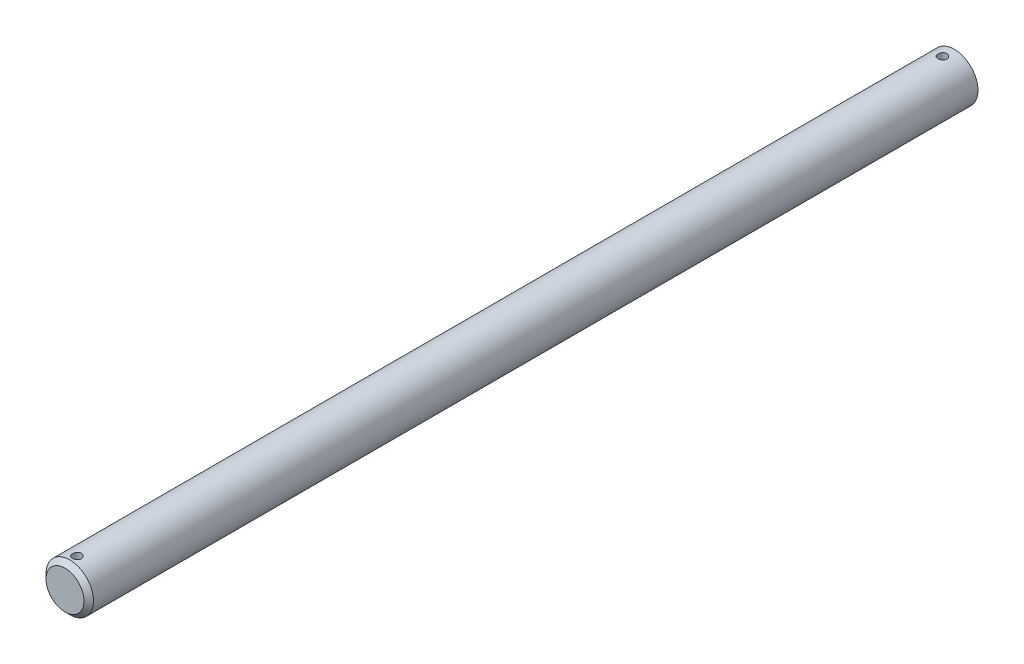
ISO-10303-21;
HEADER;
FILE_DESCRIPTION(('STEP AP214'),'2;1');
FILE_NAME('part.step','',(''),(''),'','','');
FILE_SCHEMA(('AUTOMOTIVE_DESIGN { 1 0 10303 214 1 1 1 1 }'));
ENDSEC;
DATA;
#1=APPLICATION_CONTEXT('core data for automotive mechanical design processes');
#2=APPLICATION_PROTOCOL_DEFINITION('international standard','automotive_design',2000,#1);
#3=PRODUCT_CONTEXT('',#1,'mechanical');
#4=PRODUCT('Part','Part','',(#3));
#5=PRODUCT_RELATED_PRODUCT_CATEGORY('part','',(#4));
#6=PRODUCT_DEFINITION_FORMATION('','',#4);
#7=PRODUCT_DEFINITION_CONTEXT('part definition',#1,'design');
#8=PRODUCT_DEFINITION('design','',#6,#7);
#9=PRODUCT_DEFINITION_SHAPE('','',#8);
#10=(LENGTH_UNIT() NAMED_UNIT(*) SI_UNIT(.MILLI.,.METRE.));
#11=(NAMED_UNIT(*) PLANE_ANGLE_UNIT() SI_UNIT($,.RADIAN.));
#12=(NAMED_UNIT(*) SI_UNIT($,.STERADIAN.) SOLID_ANGLE_UNIT());
#13=UNCERTAINTY_MEASURE_WITH_UNIT(LENGTH_MEASURE(1.E-05),#10,'distance_accuracy_value','');
#14=(GEOMETRIC_REPRESENTATION_CONTEXT(3) GLOBAL_UNCERTAINTY_ASSIGNED_CONTEXT((#13)) GLOBAL_UNIT_ASSIGNED_CONTEXT((#10,
#11,#12)) REPRESENTATION_CONTEXT('',''));
#15=CARTESIAN_POINT('',(0.,0.,0.));
#16=DIRECTION('',(0.,0.,1.));
#17=DIRECTION('',(1.,0.,0.));
#18=AXIS2_PLACEMENT_3D('',#15,#16,#17);
#19=CARTESIAN_POINT('',(0.,0.,304.8));
#20=DIRECTION('',(0.,0.,-1.));
#21=DIRECTION('',(-1.,0.,0.));
#22=AXIS2_PLACEMENT_3D('',#19,#20,#21);
#23=CYLINDRICAL_SURFACE('',#22,3.175);
#24=CARTESIAN_POINT('',(0.,-3.17500000000001,188.0631875));
#25=CARTESIAN_POINT('',(0.0331278493784855,-3.17499940005936,188.063186234132));
#26=CARTESIAN_POINT('',(0.0662721689897608,-3.17447616437681,188.060412916467));
#27=CARTESIAN_POINT('',(0.131626820280967,-3.17243930650301,188.049400064437));
#28=CARTESIAN_POINT('',(0.163836339741668,-3.17092484847488,188.041155916777));
#29=CARTESIAN_POINT('',(0.226366769234937,-3.16707495697542,188.019462709188));
#30=CARTESIAN_POINT('',(0.256689356240749,-3.16474026510011,188.006018349808));
#31=CARTESIAN_POINT('',(0.314645664321688,-3.1595048514429,187.974319695721));
#32=CARTESIAN_POINT('',(0.342279602808192,-3.1566041754851,187.956065790371));
#33=CARTESIAN_POINT('',(0.394407912259927,-3.15051811645857,187.915034154574));
#34=CARTESIAN_POINT('',(0.41886542902827,-3.14733001333615,187.892210001647));
#35=CARTESIAN_POINT('',(0.463627811849758,-3.14104860763278,187.842785624206));
#36=CARTESIAN_POINT('',(0.483932379579187,-3.13795531187579,187.816185128654));
#37=CARTESIAN_POINT('',(0.519965775954879,-3.13218731275362,187.759702708681));
#38=CARTESIAN_POINT('',(0.535657115316887,-3.12951611636079,187.72979647803));
#39=CARTESIAN_POINT('',(0.561778643443761,-3.12493308056008,187.667713899289));
#40=CARTESIAN_POINT('',(0.572209285923867,-3.1230211756692,187.635537747243));
#41=CARTESIAN_POINT('',(0.587395056092025,-3.120200569874,187.570223017731));
#42=CARTESIAN_POINT('',(0.592214454824665,-3.11928051754792,187.537099883297));
#43=CARTESIAN_POINT('',(0.596240425878419,-3.11851356370003,187.470503350404));
#44=CARTESIAN_POINT('',(0.595447501537278,-3.11866656594196,187.437029983624));
#45=CARTESIAN_POINT('',(0.588323450296886,-3.12001809916009,187.37114881341));
#46=CARTESIAN_POINT('',(0.582065407796812,-3.12120283233474,187.338732782137));
#47=CARTESIAN_POINT('',(0.564303860103706,-3.12446266491103,187.275419033399));
#48=CARTESIAN_POINT('',(0.552800132013025,-3.12653780214715,187.244521380514));
#49=CARTESIAN_POINT('',(0.524802287242862,-3.13135905069247,187.184907618022));
#50=CARTESIAN_POINT('',(0.508278659956949,-3.13410911079899,187.156205700738));
#51=CARTESIAN_POINT('',(0.470730932942598,-3.13996773104909,187.101954373361));
#52=CARTESIAN_POINT('',(0.449706376466779,-3.14307632756161,187.076405283626));
#53=CARTESIAN_POINT('',(0.403359563188532,-3.14936188004891,187.028762595718));
#54=CARTESIAN_POINT('',(0.377974795254098,-3.15253914125163,187.006729803558));
#55=CARTESIAN_POINT('',(0.323837314723618,-3.15855900111739,186.967226220107));
#56=CARTESIAN_POINT('',(0.295084568364029,-3.16140159642489,186.949755474555));
#57=CARTESIAN_POINT('',(0.234963886209652,-3.16643757934512,186.919862953933));
#58=CARTESIAN_POINT('',(0.203592733389718,-3.16863015282215,186.907447503288));
#59=CARTESIAN_POINT('',(0.139159898923868,-3.17211275581705,186.888079481804));
#60=CARTESIAN_POINT('',(0.106098397260253,-3.17340288121049,186.881126330645));
#61=CARTESIAN_POINT('',(0.0397464966210338,-3.17492205629787,186.87296491894));
#62=CARTESIAN_POINT('',(0.00646668626417494,-3.17516649268312,186.871673344612));
#63=CARTESIAN_POINT('',(-0.0598333703365843,-3.17460925115548,186.874648268445));
#64=CARTESIAN_POINT('',(-0.0928536292531527,-3.1738076246401,186.878914493529));
#65=CARTESIAN_POINT('',(-0.157432999370982,-3.17125791126725,186.892814648338));
#66=CARTESIAN_POINT('',(-0.189001503602659,-3.16951726067194,186.902406421507));
#67=CARTESIAN_POINT('',(-0.250082300755403,-3.16528387378086,186.926639777378));
#68=CARTESIAN_POINT('',(-0.279594453904931,-3.16279108642312,186.94128170294));
#69=CARTESIAN_POINT('',(-0.336080366506808,-3.157291557982,186.975384132113));
#70=CARTESIAN_POINT('',(-0.363022863065382,-3.1542794982553,186.994895543107));
#71=CARTESIAN_POINT('',(-0.413281147045624,-3.1480892694748,187.038114198266));
#72=CARTESIAN_POINT('',(-0.436596595436349,-3.14491108492986,187.061821834222));
#73=CARTESIAN_POINT('',(-0.479255517992202,-3.13869576292426,187.113137139068));
#74=CARTESIAN_POINT('',(-0.498542136242495,-3.1356610588829,187.140792416662));
#75=CARTESIAN_POINT('',(-0.532196179135612,-3.1301252865148,187.198999182233));
#76=CARTESIAN_POINT('',(-0.546563786592778,-3.12762419835761,187.229550562522));
#77=CARTESIAN_POINT('',(-0.569891360504028,-3.12345793983175,187.292537953562));
#78=CARTESIAN_POINT('',(-0.578877385529317,-3.12178874798387,187.324964035013));
#79=CARTESIAN_POINT('',(-0.591267071076006,-3.11946609009084,187.390899991438));
#80=CARTESIAN_POINT('',(-0.594671361418134,-3.11881250944861,187.424409743701));
#81=CARTESIAN_POINT('',(-0.595779868526294,-3.11860088672157,187.490992306541));
#82=CARTESIAN_POINT('',(-0.593573770795146,-3.11902560714798,187.524063602442));
#83=CARTESIAN_POINT('',(-0.583720477284632,-3.12088450886938,187.589355033124));
#84=CARTESIAN_POINT('',(-0.576073314010796,-3.12231868413375,187.621575172988));
#85=CARTESIAN_POINT('',(-0.555592803846086,-3.126027641217,187.684201436153));
#86=CARTESIAN_POINT('',(-0.542769168607853,-3.12830084823628,187.71461083469));
#87=CARTESIAN_POINT('',(-0.512309542245322,-3.13343285059637,187.772860838402));
#88=CARTESIAN_POINT('',(-0.49467321113813,-3.13629168730423,187.80070126191));
#89=CARTESIAN_POINT('',(-0.4547770278788,-3.14232633736512,187.853472273017));
#90=CARTESIAN_POINT('',(-0.432451906336468,-3.1455062556199,187.878353054363));
#91=CARTESIAN_POINT('',(-0.383947958425856,-3.15179405961499,187.924045173853));
#92=CARTESIAN_POINT('',(-0.357768247938247,-3.15490192863972,187.944855575827));
#93=CARTESIAN_POINT('',(-0.302015900075409,-3.1607282796232,187.981991221824));
#94=CARTESIAN_POINT('',(-0.27241483753546,-3.1634430039313,187.998274398182));
#95=CARTESIAN_POINT('',(-0.210855763856365,-3.16814048941711,188.025610437028));
#96=CARTESIAN_POINT('',(-0.178899999270518,-3.17012393770744,188.036668212109));
#97=CARTESIAN_POINT('',(-0.122375296121229,-3.17273102874592,188.05099443416));
#98=CARTESIAN_POINT('',(-0.0981367934437087,-3.17357708754789,188.055559018905));
#99=CARTESIAN_POINT('',(-0.0492685574488272,-3.17471178919249,188.061655984027));
#100=CARTESIAN_POINT('',(-0.0246388340934183,-3.1750004462058,188.063188441489));
#101=CARTESIAN_POINT('',(0.,-3.17500000000001,188.0631875));
#102=B_SPLINE_CURVE_WITH_KNOTS('',3,(#24,#25,#26,#27,#28,#29,#30,#31,#32,#33,#34,#35,#36,#37,
#38,#39,#40,#41,#42,#43,#44,#45,#46,#47,#48,#49,#50,#51,#52,#53,#54,#55,#56,#57,#58,#59,#60,#61,
#62,#63,#64,#65,#66,#67,#68,#69,#70,#71,#72,#73,#74,#75,#76,#77,#78,#79,#80,#81,#82,#83,#84,#85,
#86,#87,#88,#89,#90,#91,#92,#93,#94,#95,#96,#97,#98,#99,#100,#101),.UNSPECIFIED.,.T.,.F.,(4,2,2,
2,2,2,2,2,2,2,2,2,2,2,2,2,2,2,2,2,2,2,2,2,2,2,2,2,2,2,2,2,2,2,2,2,2,2,4),(0.,0.0992934422579592,
0.198670720631257,0.297958379519774,0.397238003055785,0.49758249961661,0.597934201813109,
0.699080193564203,0.800217460363052,0.900184538548683,1.00014265136194,1.09878415868193,
1.19742985782943,1.29666707356097,1.3959143645104,1.4967258310918,1.59753830838152,
1.69847652240176,1.79940401117395,1.89884119086454,1.99827348496884,2.09692967832173,
2.19559257087285,2.29533361900781,2.39508398463951,2.49615895304341,2.59723016460249,
2.69780792915495,2.79837434413152,2.89734328229483,2.99631162921165,3.09509515682432,
3.19388566460125,3.29415524955412,3.39444786907213,3.49564344413668,3.59674369125816,
3.67059505483131,3.74444454087574),.UNSPECIFIED.);
#103=CARTESIAN_POINT('',(0.,-3.17500000000001,188.0631875));
#104=VERTEX_POINT('',#103);
#105=EDGE_CURVE('E10',#104,#104,#102,.T.);
#106=ORIENTED_EDGE('',*,*,#105,.T.);
#107=EDGE_LOOP('',(#106));
#108=FACE_BOUND('',#107,.T.);
#109=CARTESIAN_POINT('',(0.,3.17499999999999,188.0631875));
#110=CARTESIAN_POINT('',(-0.0331278493784852,3.17499940005934,188.063186234132));
#111=CARTESIAN_POINT('',(-0.0662721689897606,3.1744761643768,188.060412916467));
#112=CARTESIAN_POINT('',(-0.131626820280967,3.17243930650299,188.049400064437));
#113=CARTESIAN_POINT('',(-0.163836339741668,3.17092484847486,188.041155916777));
#114=CARTESIAN_POINT('',(-0.226366769234937,3.1670749569754,188.019462709188));
#115=CARTESIAN_POINT('',(-0.256689356240749,3.16474026510009,188.006018349808));
#116=CARTESIAN_POINT('',(-0.314645664321687,3.15950485144288,187.974319695721));
#117=CARTESIAN_POINT('',(-0.342279602808192,3.15660417548508,187.956065790371));
#118=CARTESIAN_POINT('',(-0.394407912259927,3.15051811645855,187.915034154574));
#119=CARTESIAN_POINT('',(-0.418865429028269,3.14733001333613,187.892210001647));
#120=CARTESIAN_POINT('',(-0.463627811849758,3.14104860763276,187.842785624206));
#121=CARTESIAN_POINT('',(-0.483932379579187,3.13795531187577,187.816185128654));
#122=CARTESIAN_POINT('',(-0.519965775954873,3.1321873127536,187.759702708681));
#123=CARTESIAN_POINT('',(-0.535657115316879,3.12951611636077,187.72979647803));
#124=CARTESIAN_POINT('',(-0.561778643443756,3.12493308056006,187.667713899289));
#125=CARTESIAN_POINT('',(-0.572209285923865,3.12302117566918,187.635537747243));
#126=CARTESIAN_POINT('',(-0.587395056092024,3.12020056987398,187.570223017731));
#127=CARTESIAN_POINT('',(-0.592214454824665,3.11928051754791,187.537099883297));
#128=CARTESIAN_POINT('',(-0.596240425878419,3.11851356370001,187.470503350404));
#129=CARTESIAN_POINT('',(-0.595447501537278,3.11866656594194,187.437029983624));
#130=CARTESIAN_POINT('',(-0.588323450296886,3.12001809916007,187.37114881341));
#131=CARTESIAN_POINT('',(-0.582065407796812,3.12120283233472,187.338732782137));
#132=CARTESIAN_POINT('',(-0.564303860103706,3.12446266491101,187.275419033399));
#133=CARTESIAN_POINT('',(-0.552800132013025,3.12653780214713,187.244521380514));
#134=CARTESIAN_POINT('',(-0.524802287242861,3.13135905069245,187.184907618022));
#135=CARTESIAN_POINT('',(-0.508278659956948,3.13410911079897,187.156205700738));
#136=CARTESIAN_POINT('',(-0.470730932942597,3.13996773104907,187.101954373361));
#137=CARTESIAN_POINT('',(-0.449706376466778,3.14307632756159,187.076405283626));
#138=CARTESIAN_POINT('',(-0.403359563188532,3.14936188004889,187.028762595718));
#139=CARTESIAN_POINT('',(-0.377974795254097,3.15253914125161,187.006729803558));
#140=CARTESIAN_POINT('',(-0.323837314723618,3.15855900111738,186.967226220107));
#141=CARTESIAN_POINT('',(-0.295084568364029,3.16140159642487,186.949755474555));
#142=CARTESIAN_POINT('',(-0.234963886209651,3.1664375793451,186.919862953933));
#143=CARTESIAN_POINT('',(-0.203592733389718,3.16863015282214,186.907447503288));
#144=CARTESIAN_POINT('',(-0.139159898923867,3.17211275581703,186.888079481804));
#145=CARTESIAN_POINT('',(-0.106098397260253,3.17340288121047,186.881126330645));
#146=CARTESIAN_POINT('',(-0.0397464966210337,3.17492205629785,186.87296491894));
#147=CARTESIAN_POINT('',(-0.00646668626417481,3.1751664926831,186.871673344612));
#148=CARTESIAN_POINT('',(0.0598333703365844,3.17460925115546,186.874648268445));
#149=CARTESIAN_POINT('',(0.0928536292531528,3.17380762464008,186.878914493529));
#150=CARTESIAN_POINT('',(0.157432999370982,3.17125791126723,186.892814648338));
#151=CARTESIAN_POINT('',(0.189001503602659,3.16951726067192,186.902406421507));
#152=CARTESIAN_POINT('',(0.250082300755403,3.16528387378084,186.926639777378));
#153=CARTESIAN_POINT('',(0.279594453904931,3.1627910864231,186.94128170294));
#154=CARTESIAN_POINT('',(0.336080366506808,3.15729155798198,186.975384132113));
#155=CARTESIAN_POINT('',(0.363022863065382,3.15427949825529,186.994895543107));
#156=CARTESIAN_POINT('',(0.413281147045624,3.14808926947478,187.038114198266));
#157=CARTESIAN_POINT('',(0.436596595436349,3.14491108492984,187.061821834222));
#158=CARTESIAN_POINT('',(0.479255517992202,3.13869576292424,187.113137139068));
#159=CARTESIAN_POINT('',(0.498542136242496,3.13566105888288,187.140792416662));
#160=CARTESIAN_POINT('',(0.532196179135613,3.13012528651479,187.198999182233));
#161=CARTESIAN_POINT('',(0.546563786592779,3.12762419835759,187.229550562522));
#162=CARTESIAN_POINT('',(0.569891360504028,3.12345793983173,187.292537953562));
#163=CARTESIAN_POINT('',(0.578877385529318,3.12178874798385,187.324964035013));
#164=CARTESIAN_POINT('',(0.591267071076006,3.11946609009082,187.390899991438));
#165=CARTESIAN_POINT('',(0.594671361418134,3.11881250944859,187.424409743701));
#166=CARTESIAN_POINT('',(0.595779868526294,3.11860088672155,187.490992306541));
#167=CARTESIAN_POINT('',(0.593573770795146,3.11902560714797,187.524063602442));
#168=CARTESIAN_POINT('',(0.583720477284632,3.12088450886936,187.589355033124));
#169=CARTESIAN_POINT('',(0.576073314010796,3.12231868413373,187.621575172988));
#170=CARTESIAN_POINT('',(0.555592803846086,3.12602764121698,187.684201436153));
#171=CARTESIAN_POINT('',(0.542769168607853,3.12830084823626,187.71461083469));
#172=CARTESIAN_POINT('',(0.512309542245322,3.13343285059635,187.772860838402));
#173=CARTESIAN_POINT('',(0.49467321113813,3.13629168730421,187.80070126191));
#174=CARTESIAN_POINT('',(0.4547770278788,3.1423263373651,187.853472273017));
#175=CARTESIAN_POINT('',(0.432451906336468,3.14550625561988,187.878353054363));
#176=CARTESIAN_POINT('',(0.383947958425856,3.15179405961497,187.924045173853));
#177=CARTESIAN_POINT('',(0.357768247938247,3.1549019286397,187.944855575827));
#178=CARTESIAN_POINT('',(0.302015900075409,3.16072827962318,187.981991221824));
#179=CARTESIAN_POINT('',(0.272414837535461,3.16344300393128,187.998274398182));
#180=CARTESIAN_POINT('',(0.210855763856365,3.16814048941709,188.025610437028));
#181=CARTESIAN_POINT('',(0.178899999270518,3.17012393770742,188.036668212109));
#182=CARTESIAN_POINT('',(0.12237529612123,3.17273102874591,188.05099443416));
#183=CARTESIAN_POINT('',(0.0981367934437089,3.17357708754787,188.055559018905));
#184=CARTESIAN_POINT('',(0.0492685574488273,3.17471178919247,188.061655984027));
#185=CARTESIAN_POINT('',(0.0246388340934185,3.17500044620578,188.063188441489));
#186=CARTESIAN_POINT('',(0.,3.17499999999999,188.0631875));
#187=B_SPLINE_CURVE_WITH_KNOTS('',3,(#109,#110,#111,#112,#113,#114,#115,#116,#117,#118,#119,
#120,#121,#122,#123,#124,#125,#126,#127,#128,#129,#130,#131,#132,#133,#134,#135,#136,#137,#138,
#139,#140,#141,#142,#143,#144,#145,#146,#147,#148,#149,#150,#151,#152,#153,#154,#155,#156,#157,
#158,#159,#160,#161,#162,#163,#164,#165,#166,#167,#168,#169,#170,#171,#172,#173,#174,#175,#176,
#177,#178,#179,#180,#181,#182,#183,#184,#185,#186),.UNSPECIFIED.,.T.,.F.,(4,2,2,2,2,2,2,2,2,2,2,
2,2,2,2,2,2,2,2,2,2,2,2,2,2,2,2,2,2,2,2,2,2,2,2,2,2,2,4),(0.,0.0992934422579592,
0.198670720631257,0.297958379519774,0.397238003055785,0.49758249961661,0.597934201813109,
0.699080193564174,0.800217460363052,0.900184538548683,1.00014265136194,1.09878415868193,
1.19742985782943,1.29666707356097,1.3959143645104,1.4967258310918,1.59753830838152,
1.69847652240176,1.79940401117395,1.89884119086454,1.99827348496884,2.09692967832173,
2.19559257087285,2.29533361900781,2.39508398463951,2.49615895304341,2.59723016460249,
2.69780792915495,2.79837434413152,2.89734328229483,2.99631162921165,3.09509515682432,
3.19388566460125,3.29415524955412,3.39444786907213,3.49564344413668,3.59674369125816,
3.67059505483131,3.74444454087574),.UNSPECIFIED.);
#188=CARTESIAN_POINT('',(0.,3.17499999999999,188.0631875));
#189=VERTEX_POINT('',#188);
#190=EDGE_CURVE('E50',#189,#189,#187,.T.);
#191=ORIENTED_EDGE('',*,*,#190,.T.);
#192=EDGE_LOOP('',(#191));
#193=FACE_BOUND('',#192,.T.);
#194=CARTESIAN_POINT('',(0.,-3.17500000000001,303.8078125));
#195=CARTESIAN_POINT('',(0.0331278493784956,-3.17499940005936,303.807811234132));
#196=CARTESIAN_POINT('',(0.0662721689897699,-3.17447616437681,303.805037916467));
#197=CARTESIAN_POINT('',(0.131626820280976,-3.17243930650301,303.794025064437));
#198=CARTESIAN_POINT('',(0.163836339741677,-3.17092484847488,303.785780916777));
#199=CARTESIAN_POINT('',(0.226366769234958,-3.16707495697542,303.764087709188));
#200=CARTESIAN_POINT('',(0.256689356240781,-3.16474026510011,303.750643349808));
#201=CARTESIAN_POINT('',(0.314645664321714,-3.15950485144289,303.718944695721));
#202=CARTESIAN_POINT('',(0.342279602808203,-3.15660417548509,303.700690790371));
#203=CARTESIAN_POINT('',(0.394407912259931,-3.15051811645857,303.659659154574));
#204=CARTESIAN_POINT('',(0.41886542902828,-3.14733001333615,303.636835001646));
#205=CARTESIAN_POINT('',(0.463627811849776,-3.14104860763277,303.587410624206));
#206=CARTESIAN_POINT('',(0.483932379579207,-3.13795531187578,303.560810128654));
#207=CARTESIAN_POINT('',(0.519965775954901,-3.13218731275362,303.504327708681));
#208=CARTESIAN_POINT('',(0.535657115316909,-3.12951611636079,303.47442147803));
#209=CARTESIAN_POINT('',(0.561778643443776,-3.12493308056008,303.412338899289));
#210=CARTESIAN_POINT('',(0.572209285923881,-3.1230211756692,303.380162747243));
#211=CARTESIAN_POINT('',(0.587395056092034,-3.120200569874,303.314848017731));
#212=CARTESIAN_POINT('',(0.592214454824669,-3.11928051754792,303.281724883297));
#213=CARTESIAN_POINT('',(0.596240425878417,-3.11851356370003,303.215128350404));
#214=CARTESIAN_POINT('',(0.595447501537278,-3.11866656594196,303.181654983624));
#215=CARTESIAN_POINT('',(0.58832345029689,-3.12001809916009,303.11577381341));
#216=CARTESIAN_POINT('',(0.582065407796815,-3.12120283233474,303.083357782137));
#217=CARTESIAN_POINT('',(0.564303860103707,-3.12446266491103,303.020044033399));
#218=CARTESIAN_POINT('',(0.552800132013023,-3.12653780214715,302.989146380513));
#219=CARTESIAN_POINT('',(0.524802287242861,-3.13135905069247,302.929532618022));
#220=CARTESIAN_POINT('',(0.508278659956958,-3.13410911079899,302.900830700738));
#221=CARTESIAN_POINT('',(0.470730932942623,-3.13996773104909,302.846579373361));
#222=CARTESIAN_POINT('',(0.449706376466809,-3.14307632756161,302.821030283626));
#223=CARTESIAN_POINT('',(0.403359563188558,-3.14936188004891,302.773387595718));
#224=CARTESIAN_POINT('',(0.377974795254109,-3.15253914125163,302.751354803558));
#225=CARTESIAN_POINT('',(0.323837314723599,-3.1585590011174,302.711851220107));
#226=CARTESIAN_POINT('',(0.295084568363997,-3.16140159642489,302.694380474555));
#227=CARTESIAN_POINT('',(0.234963886209613,-3.16643757934512,302.664487953933));
#228=CARTESIAN_POINT('',(0.203592733389688,-3.16863015282216,302.652072503288));
#229=CARTESIAN_POINT('',(0.139159898923856,-3.17211275581705,302.632704481804));
#230=CARTESIAN_POINT('',(0.106098397260251,-3.17340288121049,302.625751330645));
#231=CARTESIAN_POINT('',(0.0397464966210445,-3.17492205629787,302.61758991894));
#232=CARTESIAN_POINT('',(0.00646668626418795,-3.17516649268312,302.616298344612));
#233=CARTESIAN_POINT('',(-0.0598333703365708,-3.17460925115548,302.619273268446));
#234=CARTESIAN_POINT('',(-0.0928536292531409,-3.1738076246401,302.623539493529));
#235=CARTESIAN_POINT('',(-0.157432999370963,-3.17125791126725,302.637439648338));
#236=CARTESIAN_POINT('',(-0.189001503602631,-3.16951726067195,302.647031421507));
#237=CARTESIAN_POINT('',(-0.250082300755378,-3.16528387378086,302.671264777378));
#238=CARTESIAN_POINT('',(-0.279594453904919,-3.16279108642312,302.68590670294));
#239=CARTESIAN_POINT('',(-0.33608036650679,-3.157291557982,302.720009132113));
#240=CARTESIAN_POINT('',(-0.363022863065345,-3.15427949825531,302.739520543107));
#241=CARTESIAN_POINT('',(-0.413281147045584,-3.14808926947481,302.782739198266));
#242=CARTESIAN_POINT('',(-0.436596595436325,-3.14491108492986,302.806446834222));
#243=CARTESIAN_POINT('',(-0.479255517992183,-3.13869576292427,302.857762139068));
#244=CARTESIAN_POINT('',(-0.498542136242465,-3.13566105888291,302.885417416662));
#245=CARTESIAN_POINT('',(-0.532196179135576,-3.13012528651481,302.943624182233));
#246=CARTESIAN_POINT('',(-0.546563786592745,-3.12762419835762,302.974175562522));
#247=CARTESIAN_POINT('',(-0.569891360503998,-3.12345793983176,303.037162953562));
#248=CARTESIAN_POINT('',(-0.578877385529289,-3.12178874798387,303.069589035013));
#249=CARTESIAN_POINT('',(-0.591267071075983,-3.11946609009085,303.135524991438));
#250=CARTESIAN_POINT('',(-0.594671361418111,-3.11881250944861,303.169034743701));
#251=CARTESIAN_POINT('',(-0.595779868526272,-3.11860088672157,303.235617306541));
#252=CARTESIAN_POINT('',(-0.593573770795127,-3.11902560714799,303.268688602442));
#253=CARTESIAN_POINT('',(-0.583720477284618,-3.12088450886938,303.333980033124));
#254=CARTESIAN_POINT('',(-0.57607331401078,-3.12231868413375,303.366200172988));
#255=CARTESIAN_POINT('',(-0.555592803846065,-3.12602764121701,303.428826436153));
#256=CARTESIAN_POINT('',(-0.542769168607834,-3.12830084823628,303.45923583469));
#257=CARTESIAN_POINT('',(-0.512309542245301,-3.13343285059638,303.517485838402));
#258=CARTESIAN_POINT('',(-0.4946732111381,-3.13629168730423,303.54532626191));
#259=CARTESIAN_POINT('',(-0.454777027878766,-3.14232633736512,303.598097273017));
#260=CARTESIAN_POINT('',(-0.432451906336444,-3.1455062556199,303.622978054363));
#261=CARTESIAN_POINT('',(-0.383947958425829,-3.15179405961499,303.668670173853));
#262=CARTESIAN_POINT('',(-0.357768247938207,-3.15490192863972,303.689480575826));
#263=CARTESIAN_POINT('',(-0.302015900075373,-3.16072827962321,303.726616221824));
#264=CARTESIAN_POINT('',(-0.272414837535442,-3.1634430039313,303.742899398182));
#265=CARTESIAN_POINT('',(-0.21085576385636,-3.16814048941711,303.770235437028));
#266=CARTESIAN_POINT('',(-0.178899999270509,-3.17012393770744,303.781293212109));
#267=CARTESIAN_POINT('',(-0.122375296121215,-3.17273102874592,303.79561943416));
#268=CARTESIAN_POINT('',(-0.0981367934436929,-3.17357708754789,303.800184018905));
#269=CARTESIAN_POINT('',(-0.0492685574488116,-3.17471178919249,303.806280984027));
#270=CARTESIAN_POINT('',(-0.0246388340934046,-3.1750004462058,303.807813441489));
#271=CARTESIAN_POINT('',(0.,-3.17500000000001,303.8078125));
#272=B_SPLINE_CURVE_WITH_KNOTS('',3,(#194,#195,#196,#197,#198,#199,#200,#201,#202,#203,#204,
#205,#206,#207,#208,#209,#210,#211,#212,#213,#214,#215,#216,#217,#218,#219,#220,#221,#222,#223,
#224,#225,#226,#227,#228,#229,#230,#231,#232,#233,#234,#235,#236,#237,#238,#239,#240,#241,#242,
#243,#244,#245,#246,#247,#248,#249,#250,#251,#252,#253,#254,#255,#256,#257,#258,#259,#260,#261,
#262,#263,#264,#265,#266,#267,#268,#269,#270,#271),.UNSPECIFIED.,.T.,.F.,(4,2,2,2,2,2,2,2,2,2,2,
2,2,2,2,2,2,2,2,2,2,2,2,2,2,2,2,2,2,2,2,2,2,2,2,2,2,2,4),(0.,0.0992934422579537,
0.198670720631256,0.297958379519797,0.397238003055775,0.497582499616633,0.597934201813132,
0.699080193564254,0.800217460363045,0.900184538548675,1.00014265136191,1.09878415868192,
1.19742985782948,1.29666707356095,1.39591436451032,1.49672583109181,1.59753830838155,
1.69847652240177,1.79940401117393,1.89884119086451,1.99827348496881,2.09692967832168,
2.1955925708728,2.29533361900778,2.39508398463947,2.49615895304333,2.59723016460242,
2.69780792915486,2.79837434413146,2.89734328229474,2.99631162921161,3.09509515682426,
3.19388566460124,3.29415524955408,3.39444786907209,3.49564344413663,3.5967436912581,
3.67059505483126,3.74444454087568),.UNSPECIFIED.);
#273=CARTESIAN_POINT('',(0.,-3.17500000000001,303.8078125));
#274=VERTEX_POINT('',#273);
#275=EDGE_CURVE('E57',#274,#274,#272,.T.);
#276=ORIENTED_EDGE('',*,*,#275,.T.);
#277=EDGE_LOOP('',(#276));
#278=FACE_BOUND('',#277,.T.);
#279=CARTESIAN_POINT('',(0.,3.17499999999999,303.8078125));
#280=CARTESIAN_POINT('',(-0.0331278493784698,3.17499940005934,303.807811234132));
#281=CARTESIAN_POINT('',(-0.0662721689897442,3.17447616437679,303.805037916467));
#282=CARTESIAN_POINT('',(-0.13162682028095,3.17243930650299,303.794025064437));
#283=CARTESIAN_POINT('',(-0.163836339741651,3.17092484847486,303.785780916777));
#284=CARTESIAN_POINT('',(-0.226366769234933,3.1670749569754,303.764087709188));
#285=CARTESIAN_POINT('',(-0.256689356240756,3.16474026510009,303.750643349808));
#286=CARTESIAN_POINT('',(-0.314645664321688,3.15950485144288,303.718944695721));
#287=CARTESIAN_POINT('',(-0.342279602808177,3.15660417548508,303.700690790371));
#288=CARTESIAN_POINT('',(-0.394407912259905,3.15051811645856,303.659659154574));
#289=CARTESIAN_POINT('',(-0.418865429028254,3.14733001333614,303.636835001646));
#290=CARTESIAN_POINT('',(-0.46362781184975,3.14104860763276,303.587410624206));
#291=CARTESIAN_POINT('',(-0.483932379579181,3.13795531187577,303.560810128654));
#292=CARTESIAN_POINT('',(-0.519965775954875,3.1321873127536,303.504327708681));
#293=CARTESIAN_POINT('',(-0.535657115316883,3.12951611636077,303.47442147803));
#294=CARTESIAN_POINT('',(-0.56177864344375,3.12493308056007,303.412338899289));
#295=CARTESIAN_POINT('',(-0.572209285923855,3.12302117566919,303.380162747243));
#296=CARTESIAN_POINT('',(-0.587395056092009,3.12020056987399,303.314848017731));
#297=CARTESIAN_POINT('',(-0.592214454824643,3.11928051754791,303.281724883297));
#298=CARTESIAN_POINT('',(-0.596240425878392,3.11851356370001,303.215128350404));
#299=CARTESIAN_POINT('',(-0.595447501537253,3.11866656594195,303.181654983624));
#300=CARTESIAN_POINT('',(-0.588323450296865,3.12001809916008,303.11577381341));
#301=CARTESIAN_POINT('',(-0.58206540779679,3.12120283233473,303.083357782137));
#302=CARTESIAN_POINT('',(-0.564303860103681,3.12446266491101,303.020044033399));
#303=CARTESIAN_POINT('',(-0.552800132012997,3.12653780214714,302.989146380513));
#304=CARTESIAN_POINT('',(-0.524802287242835,3.13135905069245,302.929532618022));
#305=CARTESIAN_POINT('',(-0.508278659956932,3.13410911079897,302.900830700738));
#306=CARTESIAN_POINT('',(-0.470730932942597,3.13996773104907,302.846579373361));
#307=CARTESIAN_POINT('',(-0.449706376466783,3.14307632756159,302.821030283626));
#308=CARTESIAN_POINT('',(-0.403359563188532,3.14936188004889,302.773387595718));
#309=CARTESIAN_POINT('',(-0.377974795254083,3.15253914125161,302.751354803558));
#310=CARTESIAN_POINT('',(-0.323837314723573,3.15855900111738,302.711851220107));
#311=CARTESIAN_POINT('',(-0.295084568363971,3.16140159642487,302.694380474555));
#312=CARTESIAN_POINT('',(-0.234963886209588,3.16643757934511,302.664487953933));
#313=CARTESIAN_POINT('',(-0.203592733389662,3.16863015282214,302.652072503288));
#314=CARTESIAN_POINT('',(-0.13915989892383,3.17211275581703,302.632704481804));
#315=CARTESIAN_POINT('',(-0.106098397260226,3.17340288121047,302.625751330645));
#316=CARTESIAN_POINT('',(-0.0397464966210191,3.17492205629785,302.61758991894));
#317=CARTESIAN_POINT('',(-0.00646668626416251,3.1751664926831,302.616298344612));
#318=CARTESIAN_POINT('',(0.0598333703365961,3.17460925115546,302.619273268446));
#319=CARTESIAN_POINT('',(0.0928536292531661,3.17380762464008,302.623539493529));
#320=CARTESIAN_POINT('',(0.157432999370988,3.17125791126723,302.637439648338));
#321=CARTESIAN_POINT('',(0.189001503602656,3.16951726067193,302.647031421507));
#322=CARTESIAN_POINT('',(0.250082300755404,3.16528387378084,302.671264777378));
#323=CARTESIAN_POINT('',(0.279594453904944,3.1627910864231,302.68590670294));
#324=CARTESIAN_POINT('',(0.336080366506815,3.15729155798198,302.720009132113));
#325=CARTESIAN_POINT('',(0.36302286306537,3.15427949825529,302.739520543107));
#326=CARTESIAN_POINT('',(0.413281147045609,3.14808926947478,302.782739198266));
#327=CARTESIAN_POINT('',(0.436596595436351,3.14491108492984,302.806446834222));
#328=CARTESIAN_POINT('',(0.479255517992208,3.13869576292424,302.857762139068));
#329=CARTESIAN_POINT('',(0.49854213624249,3.13566105888288,302.885417416662));
#330=CARTESIAN_POINT('',(0.532196179135601,3.13012528651479,302.943624182233));
#331=CARTESIAN_POINT('',(0.54656378659277,3.1276241983576,302.974175562522));
#332=CARTESIAN_POINT('',(0.569891360504023,3.12345793983173,303.037162953562));
#333=CARTESIAN_POINT('',(0.578877385529315,3.12178874798385,303.069589035013));
#334=CARTESIAN_POINT('',(0.591267071076009,3.11946609009082,303.135524991438));
#335=CARTESIAN_POINT('',(0.594671361418136,3.11881250944859,303.169034743701));
#336=CARTESIAN_POINT('',(0.595779868526297,3.11860088672155,303.235617306541));
#337=CARTESIAN_POINT('',(0.593573770795153,3.11902560714796,303.268688602442));
#338=CARTESIAN_POINT('',(0.583720477284644,3.12088450886935,303.333980033124));
#339=CARTESIAN_POINT('',(0.576073314010806,3.12231868413373,303.366200172988));
#340=CARTESIAN_POINT('',(0.555592803846091,3.12602764121698,303.428826436153));
#341=CARTESIAN_POINT('',(0.54276916860786,3.12830084823626,303.45923583469));
#342=CARTESIAN_POINT('',(0.512309542245326,3.13343285059635,303.517485838402));
#343=CARTESIAN_POINT('',(0.494673211138126,3.13629168730421,303.54532626191));
#344=CARTESIAN_POINT('',(0.454777027878792,3.1423263373651,303.598097273017));
#345=CARTESIAN_POINT('',(0.432451906336469,3.14550625561988,303.622978054363));
#346=CARTESIAN_POINT('',(0.383947958425855,3.15179405961497,303.668670173853));
#347=CARTESIAN_POINT('',(0.357768247938233,3.1549019286397,303.689480575826));
#348=CARTESIAN_POINT('',(0.302015900075392,3.16072827962318,303.726616221824));
#349=CARTESIAN_POINT('',(0.272414837535453,3.16344300393128,303.742899398182));
#350=CARTESIAN_POINT('',(0.210855763856371,3.16814048941709,303.770235437028));
#351=CARTESIAN_POINT('',(0.178899999270528,3.17012393770742,303.781293212109));
#352=CARTESIAN_POINT('',(0.122375296121242,3.1727310287459,303.79561943416));
#353=CARTESIAN_POINT('',(0.0981367934437188,3.17357708754787,303.800184018905));
#354=CARTESIAN_POINT('',(0.0492685574488371,3.17471178919247,303.806280984027));
#355=CARTESIAN_POINT('',(0.0246388340934303,3.17500044620578,303.807813441489));
#356=CARTESIAN_POINT('',(0.,3.17499999999999,303.8078125));
#357=B_SPLINE_CURVE_WITH_KNOTS('',3,(#279,#280,#281,#282,#283,#284,#285,#286,#287,#288,#289,
#290,#291,#292,#293,#294,#295,#296,#297,#298,#299,#300,#301,#302,#303,#304,#305,#306,#307,#308,
#309,#310,#311,#312,#313,#314,#315,#316,#317,#318,#319,#320,#321,#322,#323,#324,#325,#326,#327,
#328,#329,#330,#331,#332,#333,#334,#335,#336,#337,#338,#339,#340,#341,#342,#343,#344,#345,#346,
#347,#348,#349,#350,#351,#352,#353,#354,#355,#356),.UNSPECIFIED.,.T.,.F.,(4,2,2,2,2,2,2,2,2,2,2,
2,2,2,2,2,2,2,2,2,2,2,2,2,2,2,2,2,2,2,2,2,2,2,2,2,2,2,4),(0.,0.0992934422579536,
0.198670720631256,0.297958379519797,0.397238003055775,0.497582499616632,0.597934201813132,
0.699080193564254,0.800217460363045,0.900184538548675,1.00014265136191,1.09878415868192,
1.19742985782948,1.29666707356095,1.39591436451032,1.49672583109181,1.59753830838155,
1.69847652240177,1.79940401117393,1.89884119086451,1.99827348496881,2.09692967832168,
2.1955925708728,2.29533361900778,2.39508398463947,2.49615895304333,2.59723016460242,
2.69780792915486,2.79837434413146,2.89734328229474,2.99631162921161,3.09509515682425,
3.19388566460124,3.29415524955408,3.39444786907209,3.49564344413664,3.5967436912581,
3.67059505483125,3.74444454087568),.UNSPECIFIED.);
#358=CARTESIAN_POINT('',(0.,3.17499999999999,303.8078125));
#359=VERTEX_POINT('',#358);
#360=EDGE_CURVE('E63',#359,#359,#357,.T.);
#361=ORIENTED_EDGE('',*,*,#360,.T.);
#362=EDGE_LOOP('',(#361));
#363=FACE_BOUND('',#362,.T.);
#364=CARTESIAN_POINT('',(0.,0.,185.880375));
#365=DIRECTION('',(0.,0.,1.));
#366=DIRECTION('',(1.,0.,0.));
#367=AXIS2_PLACEMENT_3D('',#364,#365,#366);
#368=CIRCLE('',#367,3.175);
#369=CARTESIAN_POINT('',(3.175,0.,185.880375));
#370=VERTEX_POINT('',#369);
#371=EDGE_CURVE('E99',#370,#370,#368,.T.);
#372=ORIENTED_EDGE('',*,*,#371,.T.);
#373=EDGE_LOOP('',(#372));
#374=FACE_BOUND('',#373,.T.);
#375=CARTESIAN_POINT('',(0.,0.,304.165));
#376=DIRECTION('',(0.,0.,1.));
#377=DIRECTION('',(1.,0.,0.));
#378=AXIS2_PLACEMENT_3D('',#375,#376,#377);
#379=CIRCLE('',#378,3.175);
#380=CARTESIAN_POINT('',(3.175,0.,304.165));
#381=VERTEX_POINT('',#380);
#382=EDGE_CURVE('E95',#381,#381,#379,.F.);
#383=ORIENTED_EDGE('',*,*,#382,.T.);
#384=EDGE_LOOP('',(#383));
#385=FACE_BOUND('',#384,.T.);
#386=ADVANCED_FACE('F38',(#108,#193,#278,#363,#374,#385),#23,.T.);
#387=CARTESIAN_POINT('',(0.,0.,304.8));
#388=DIRECTION('',(0.,0.,1.));
#389=DIRECTION('',(1.,0.,0.));
#390=AXIS2_PLACEMENT_3D('',#387,#388,#389);
#391=PLANE('',#390);
#392=CARTESIAN_POINT('',(0.,0.,304.8));
#393=DIRECTION('',(0.,0.,1.));
#394=DIRECTION('',(1.,0.,0.));
#395=AXIS2_PLACEMENT_3D('',#392,#393,#394);
#396=CIRCLE('',#395,2.54000000000021);
#397=CARTESIAN_POINT('',(2.54000000000021,0.,304.8));
#398=VERTEX_POINT('',#397);
#399=EDGE_CURVE('E92',#398,#398,#396,.T.);
#400=ORIENTED_EDGE('',*,*,#399,.T.);
#401=EDGE_LOOP('',(#400));
#402=FACE_BOUND('',#401,.T.);
#403=ADVANCED_FACE('F109',(#402),#391,.T.);
#404=CARTESIAN_POINT('',(0.,0.,304.8));
#405=DIRECTION('',(0.,0.,-1.));
#406=DIRECTION('',(-1.,0.,0.));
#407=AXIS2_PLACEMENT_3D('',#404,#405,#406);
#408=CONICAL_SURFACE('',#407,2.54000000000021,0.785398163397418);
#409=ORIENTED_EDGE('',*,*,#382,.F.);
#410=EDGE_LOOP('',(#409));
#411=FACE_BOUND('',#410,.T.);
#412=ORIENTED_EDGE('',*,*,#399,.F.);
#413=EDGE_LOOP('',(#412));
#414=FACE_BOUND('',#413,.T.);
#415=ADVANCED_FACE('F40',(#411,#414),#408,.T.);
#416=CARTESIAN_POINT('',(0.,0.,185.880375));
#417=DIRECTION('',(0.,0.,1.));
#418=DIRECTION('',(1.,0.,0.));
#419=AXIS2_PLACEMENT_3D('',#416,#417,#418);
#420=PLANE('',#419);
#421=ORIENTED_EDGE('',*,*,#371,.F.);
#422=EDGE_LOOP('',(#421));
#423=FACE_BOUND('',#422,.T.);
#424=ADVANCED_FACE('F84',(#423),#420,.F.);
#425=CARTESIAN_POINT('',(0.,-3.17500000000001,303.2125));
#426=DIRECTION('',(0.,1.,0.));
#427=DIRECTION('',(0.,0.,1.));
#428=AXIS2_PLACEMENT_3D('',#425,#426,#427);
#429=CYLINDRICAL_SURFACE('',#428,0.595312500000002);
#430=ORIENTED_EDGE('',*,*,#360,.F.);
#431=EDGE_LOOP('',(#430));
#432=FACE_BOUND('',#431,.T.);
#433=ORIENTED_EDGE('',*,*,#275,.F.);
#434=EDGE_LOOP('',(#433));
#435=FACE_BOUND('',#434,.T.);
#436=ADVANCED_FACE('F78',(#432,#435),#429,.F.);
#437=CARTESIAN_POINT('',(0.,-3.17500000000001,187.467875));
#438=DIRECTION('',(0.,1.,0.));
#439=DIRECTION('',(0.,0.,1.));
#440=AXIS2_PLACEMENT_3D('',#437,#438,#439);
#441=CYLINDRICAL_SURFACE('',#440,0.595312500000011);
#442=ORIENTED_EDGE('',*,*,#190,.F.);
#443=EDGE_LOOP('',(#442));
#444=FACE_BOUND('',#443,.T.);
#445=ORIENTED_EDGE('',*,*,#105,.F.);
#446=EDGE_LOOP('',(#445));
#447=FACE_BOUND('',#446,.T.);
#448=ADVANCED_FACE('F75',(#444,#447),#441,.F.);
#449=CLOSED_SHELL('',(#386,#403,#415,#424,#436,#448));
#450=MANIFOLD_SOLID_BREP('B2',#449);
#451=ADVANCED_BREP_SHAPE_REPRESENTATION('',(#18,#450),#14);
#452=SHAPE_DEFINITION_REPRESENTATION(#9,#451);
ENDSEC;
END-ISO-10303-21;
